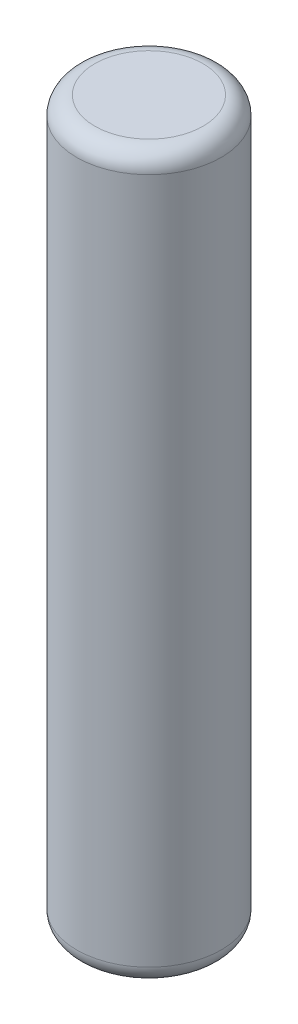
ISO-10303-21;
HEADER;
FILE_DESCRIPTION(('STEP AP214'),'2;1');
FILE_NAME('part.step','',(''),(''),'','','');
FILE_SCHEMA(('AUTOMOTIVE_DESIGN { 1 0 10303 214 1 1 1 1 }'));
ENDSEC;
DATA;
#1=APPLICATION_CONTEXT('core data for automotive mechanical design processes');
#2=APPLICATION_PROTOCOL_DEFINITION('international standard','automotive_design',2000,#1);
#3=PRODUCT_CONTEXT('',#1,'mechanical');
#4=PRODUCT('Part','Part','',(#3));
#5=PRODUCT_RELATED_PRODUCT_CATEGORY('part','',(#4));
#6=PRODUCT_DEFINITION_FORMATION('','',#4);
#7=PRODUCT_DEFINITION_CONTEXT('part definition',#1,'design');
#8=PRODUCT_DEFINITION('design','',#6,#7);
#9=PRODUCT_DEFINITION_SHAPE('','',#8);
#10=(LENGTH_UNIT() NAMED_UNIT(*) SI_UNIT(.MILLI.,.METRE.));
#11=(NAMED_UNIT(*) PLANE_ANGLE_UNIT() SI_UNIT($,.RADIAN.));
#12=(NAMED_UNIT(*) SI_UNIT($,.STERADIAN.) SOLID_ANGLE_UNIT());
#13=UNCERTAINTY_MEASURE_WITH_UNIT(LENGTH_MEASURE(1.E-05),#10,'distance_accuracy_value','');
#14=(GEOMETRIC_REPRESENTATION_CONTEXT(3) GLOBAL_UNCERTAINTY_ASSIGNED_CONTEXT((#13)) GLOBAL_UNIT_ASSIGNED_CONTEXT((#10,
#11,#12)) REPRESENTATION_CONTEXT('',''));
#15=CARTESIAN_POINT('',(0.,0.,0.));
#16=DIRECTION('',(0.,0.,1.));
#17=DIRECTION('',(1.,0.,0.));
#18=AXIS2_PLACEMENT_3D('',#15,#16,#17);
#19=CARTESIAN_POINT('',(0.,40.,0.));
#20=DIRECTION('',(0.,-1.,0.));
#21=DIRECTION('',(0.,0.,-1.));
#22=AXIS2_PLACEMENT_3D('',#19,#20,#21);
#23=CYLINDRICAL_SURFACE('',#22,4.);
#24=CARTESIAN_POINT('',(0.,1.,0.));
#25=DIRECTION('',(0.,1.,0.));
#26=DIRECTION('',(0.,0.,1.));
#27=AXIS2_PLACEMENT_3D('',#24,#25,#26);
#28=CIRCLE('',#27,4.);
#29=CARTESIAN_POINT('',(0.,1.,4.));
#30=VERTEX_POINT('',#29);
#31=EDGE_CURVE('E43',#30,#30,#28,.T.);
#32=ORIENTED_EDGE('',*,*,#31,.T.);
#33=EDGE_LOOP('',(#32));
#34=FACE_BOUND('',#33,.T.);
#35=CARTESIAN_POINT('',(0.,39.,0.));
#36=DIRECTION('',(0.,1.,0.));
#37=DIRECTION('',(0.,0.,1.));
#38=AXIS2_PLACEMENT_3D('',#35,#36,#37);
#39=CIRCLE('',#38,4.);
#40=CARTESIAN_POINT('',(0.,39.,4.));
#41=VERTEX_POINT('',#40);
#42=EDGE_CURVE('E47',#41,#41,#39,.F.);
#43=ORIENTED_EDGE('',*,*,#42,.T.);
#44=EDGE_LOOP('',(#43));
#45=FACE_BOUND('',#44,.T.);
#46=ADVANCED_FACE('F32',(#34,#45),#23,.T.);
#47=CARTESIAN_POINT('',(0.,40.,0.));
#48=DIRECTION('',(0.,1.,0.));
#49=DIRECTION('',(0.,0.,1.));
#50=AXIS2_PLACEMENT_3D('',#47,#48,#49);
#51=PLANE('',#50);
#52=CARTESIAN_POINT('',(0.,40.,0.));
#53=DIRECTION('',(0.,1.,0.));
#54=DIRECTION('',(0.,0.,1.));
#55=AXIS2_PLACEMENT_3D('',#52,#53,#54);
#56=CIRCLE('',#55,3.);
#57=CARTESIAN_POINT('',(0.,40.,3.));
#58=VERTEX_POINT('',#57);
#59=EDGE_CURVE('E10',#58,#58,#56,.T.);
#60=ORIENTED_EDGE('',*,*,#59,.T.);
#61=EDGE_LOOP('',(#60));
#62=FACE_BOUND('',#61,.T.);
#63=ADVANCED_FACE('F63',(#62),#51,.T.);
#64=CARTESIAN_POINT('',(0.,0.,0.));
#65=DIRECTION('',(0.,1.,0.));
#66=DIRECTION('',(0.,0.,1.));
#67=AXIS2_PLACEMENT_3D('',#64,#65,#66);
#68=PLANE('',#67);
#69=CARTESIAN_POINT('',(0.,0.,0.));
#70=DIRECTION('',(0.,1.,0.));
#71=DIRECTION('',(0.,0.,1.));
#72=AXIS2_PLACEMENT_3D('',#69,#70,#71);
#73=CIRCLE('',#72,3.);
#74=CARTESIAN_POINT('',(0.,0.,3.));
#75=VERTEX_POINT('',#74);
#76=EDGE_CURVE('E39',#75,#75,#73,.F.);
#77=ORIENTED_EDGE('',*,*,#76,.T.);
#78=EDGE_LOOP('',(#77));
#79=FACE_BOUND('',#78,.T.);
#80=ADVANCED_FACE('F60',(#79),#68,.F.);
#81=CARTESIAN_POINT('',(0.,1.,0.));
#82=DIRECTION('',(0.,1.,0.));
#83=DIRECTION('',(0.,0.,1.));
#84=AXIS2_PLACEMENT_3D('',#81,#82,#83);
#85=TOROIDAL_SURFACE('',#84,3.,1.);
#86=ORIENTED_EDGE('',*,*,#76,.F.);
#87=EDGE_LOOP('',(#86));
#88=FACE_BOUND('',#87,.T.);
#89=ORIENTED_EDGE('',*,*,#31,.F.);
#90=EDGE_LOOP('',(#89));
#91=FACE_BOUND('',#90,.T.);
#92=ADVANCED_FACE('F56',(#88,#91),#85,.T.);
#93=CARTESIAN_POINT('',(0.,39.,0.));
#94=DIRECTION('',(0.,1.,0.));
#95=DIRECTION('',(0.,0.,1.));
#96=AXIS2_PLACEMENT_3D('',#93,#94,#95);
#97=TOROIDAL_SURFACE('',#96,3.,1.);
#98=ORIENTED_EDGE('',*,*,#42,.F.);
#99=EDGE_LOOP('',(#98));
#100=FACE_BOUND('',#99,.T.);
#101=ORIENTED_EDGE('',*,*,#59,.F.);
#102=EDGE_LOOP('',(#101));
#103=FACE_BOUND('',#102,.T.);
#104=ADVANCED_FACE('F34',(#100,#103),#97,.T.);
#105=CLOSED_SHELL('',(#46,#63,#80,#92,#104));
#106=MANIFOLD_SOLID_BREP('B2',#105);
#107=ADVANCED_BREP_SHAPE_REPRESENTATION('',(#18,#106),#14);
#108=SHAPE_DEFINITION_REPRESENTATION(#9,#107);
ENDSEC;
END-ISO-10303-21;
